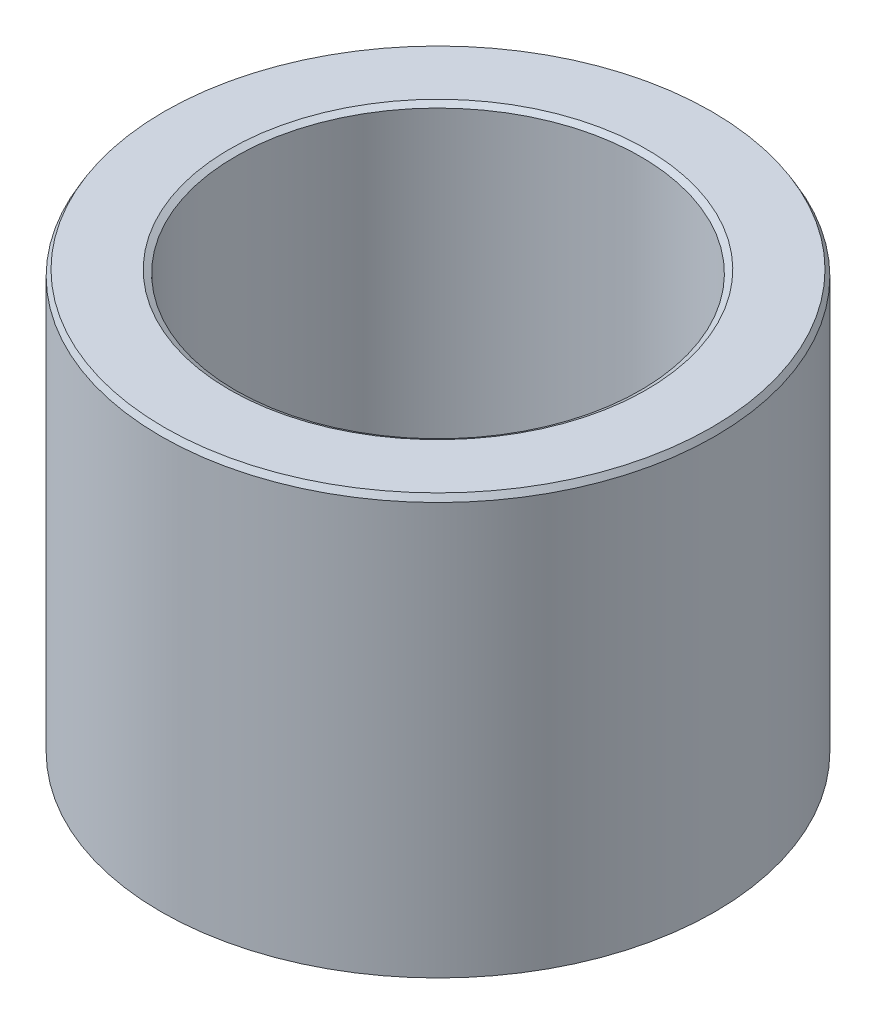
ISO-10303-21;
HEADER;
FILE_DESCRIPTION(('STEP AP214'),'2;1');
FILE_NAME('part.step','',(''),(''),'','','');
FILE_SCHEMA(('AUTOMOTIVE_DESIGN { 1 0 10303 214 1 1 1 1 }'));
ENDSEC;
DATA;
#1=APPLICATION_CONTEXT('core data for automotive mechanical design processes');
#2=APPLICATION_PROTOCOL_DEFINITION('international standard','automotive_design',2000,#1);
#3=PRODUCT_CONTEXT('',#1,'mechanical');
#4=PRODUCT('Part','Part','',(#3));
#5=PRODUCT_RELATED_PRODUCT_CATEGORY('part','',(#4));
#6=PRODUCT_DEFINITION_FORMATION('','',#4);
#7=PRODUCT_DEFINITION_CONTEXT('part definition',#1,'design');
#8=PRODUCT_DEFINITION('design','',#6,#7);
#9=PRODUCT_DEFINITION_SHAPE('','',#8);
#10=(LENGTH_UNIT() NAMED_UNIT(*) SI_UNIT(.MILLI.,.METRE.));
#11=(NAMED_UNIT(*) PLANE_ANGLE_UNIT() SI_UNIT($,.RADIAN.));
#12=(NAMED_UNIT(*) SI_UNIT($,.STERADIAN.) SOLID_ANGLE_UNIT());
#13=UNCERTAINTY_MEASURE_WITH_UNIT(LENGTH_MEASURE(1.E-05),#10,'distance_accuracy_value','');
#14=(GEOMETRIC_REPRESENTATION_CONTEXT(3) GLOBAL_UNCERTAINTY_ASSIGNED_CONTEXT((#13)) GLOBAL_UNIT_ASSIGNED_CONTEXT((#10,
#11,#12)) REPRESENTATION_CONTEXT('',''));
#15=CARTESIAN_POINT('',(0.,0.,0.));
#16=DIRECTION('',(0.,0.,1.));
#17=DIRECTION('',(1.,0.,0.));
#18=AXIS2_PLACEMENT_3D('',#15,#16,#17);
#19=CARTESIAN_POINT('',(0.,64.5880253168317,0.));
#20=DIRECTION('',(0.,-1.,0.));
#21=DIRECTION('',(0.,0.,-1.));
#22=AXIS2_PLACEMENT_3D('',#19,#20,#21);
#23=CYLINDRICAL_SURFACE('',#22,42.5);
#24=CARTESIAN_POINT('',(0.,0.524963603756048,0.));
#25=DIRECTION('',(0.,1.,0.));
#26=DIRECTION('',(0.,0.,1.));
#27=AXIS2_PLACEMENT_3D('',#24,#25,#26);
#28=CIRCLE('',#27,42.5);
#29=CARTESIAN_POINT('',(0.,0.524963603756048,42.5));
#30=VERTEX_POINT('',#29);
#31=EDGE_CURVE('E10',#30,#30,#28,.T.);
#32=ORIENTED_EDGE('',*,*,#31,.T.);
#33=EDGE_LOOP('',(#32));
#34=FACE_BOUND('',#33,.T.);
#35=CARTESIAN_POINT('',(0.,63.6787616830017,0.));
#36=DIRECTION('',(0.,1.,0.));
#37=DIRECTION('',(0.,0.,1.));
#38=AXIS2_PLACEMENT_3D('',#35,#36,#37);
#39=CIRCLE('',#38,42.5);
#40=CARTESIAN_POINT('',(0.,63.6787616830017,42.5));
#41=VERTEX_POINT('',#40);
#42=EDGE_CURVE('E50',#41,#41,#39,.F.);
#43=ORIENTED_EDGE('',*,*,#42,.T.);
#44=EDGE_LOOP('',(#43));
#45=FACE_BOUND('',#44,.T.);
#46=ADVANCED_FACE('F39',(#34,#45),#23,.T.);
#47=CARTESIAN_POINT('',(0.,64.5880253168317,0.));
#48=DIRECTION('',(0.,1.,0.));
#49=DIRECTION('',(0.,0.,1.));
#50=AXIS2_PLACEMENT_3D('',#47,#48,#49);
#51=PLANE('',#50);
#52=CARTESIAN_POINT('',(0.,64.5880253168317,0.));
#53=DIRECTION('',(0.,1.,0.));
#54=DIRECTION('',(0.,0.,1.));
#55=AXIS2_PLACEMENT_3D('',#52,#53,#54);
#56=CIRCLE('',#55,31.9728444741775);
#57=CARTESIAN_POINT('',(0.,64.5880253168317,31.9728444741775));
#58=VERTEX_POINT('',#57);
#59=EDGE_CURVE('E58',#58,#58,#56,.F.);
#60=ORIENTED_EDGE('',*,*,#59,.T.);
#61=EDGE_LOOP('',(#60));
#62=FACE_BOUND('',#61,.T.);
#63=CARTESIAN_POINT('',(0.,64.5880253168317,0.));
#64=DIRECTION('',(0.,1.,0.));
#65=DIRECTION('',(0.,0.,1.));
#66=AXIS2_PLACEMENT_3D('',#63,#64,#65);
#67=CIRCLE('',#66,41.9750363962439);
#68=CARTESIAN_POINT('',(0.,64.5880253168317,41.9750363962439));
#69=VERTEX_POINT('',#68);
#70=EDGE_CURVE('E61',#69,#69,#67,.T.);
#71=ORIENTED_EDGE('',*,*,#70,.T.);
#72=EDGE_LOOP('',(#71));
#73=FACE_BOUND('',#72,.T.);
#74=ADVANCED_FACE('F88',(#62,#73),#51,.T.);
#75=CARTESIAN_POINT('',(0.,0.,0.));
#76=DIRECTION('',(0.,1.,0.));
#77=DIRECTION('',(0.,0.,1.));
#78=AXIS2_PLACEMENT_3D('',#75,#76,#77);
#79=PLANE('',#78);
#80=CARTESIAN_POINT('',(0.,0.,0.));
#81=DIRECTION('',(0.,1.,0.));
#82=DIRECTION('',(0.,0.,1.));
#83=AXIS2_PLACEMENT_3D('',#80,#81,#82);
#84=CIRCLE('',#83,31.5885444441036);
#85=CARTESIAN_POINT('',(0.,0.,31.5885444441036));
#86=VERTEX_POINT('',#85);
#87=EDGE_CURVE('E51',#86,#86,#84,.T.);
#88=ORIENTED_EDGE('',*,*,#87,.T.);
#89=EDGE_LOOP('',(#88));
#90=FACE_BOUND('',#89,.T.);
#91=CARTESIAN_POINT('',(0.,0.,0.));
#92=DIRECTION('',(0.,1.,0.));
#93=DIRECTION('',(0.,0.,1.));
#94=AXIS2_PLACEMENT_3D('',#91,#92,#93);
#95=CIRCLE('',#94,41.5907363661701);
#96=CARTESIAN_POINT('',(0.,0.,41.5907363661701));
#97=VERTEX_POINT('',#96);
#98=EDGE_CURVE('E54',#97,#97,#95,.F.);
#99=ORIENTED_EDGE('',*,*,#98,.T.);
#100=EDGE_LOOP('',(#99));
#101=FACE_BOUND('',#100,.T.);
#102=ADVANCED_FACE('F83',(#90,#101),#79,.F.);
#103=CARTESIAN_POINT('',(0.,64.5880253168317,0.));
#104=DIRECTION('',(0.,-1.,0.));
#105=DIRECTION('',(0.,0.,-1.));
#106=AXIS2_PLACEMENT_3D('',#103,#104,#105);
#107=CYLINDRICAL_SURFACE('',#106,31.0635808403476);
#108=CARTESIAN_POINT('',(0.,64.0630617130757,0.));
#109=DIRECTION('',(0.,1.,0.));
#110=DIRECTION('',(0.,0.,1.));
#111=AXIS2_PLACEMENT_3D('',#108,#109,#110);
#112=CIRCLE('',#111,31.0635808403476);
#113=CARTESIAN_POINT('',(0.,64.0630617130757,31.0635808403476));
#114=VERTEX_POINT('',#113);
#115=EDGE_CURVE('E67',#114,#114,#112,.T.);
#116=ORIENTED_EDGE('',*,*,#115,.T.);
#117=EDGE_LOOP('',(#116));
#118=FACE_BOUND('',#117,.T.);
#119=CARTESIAN_POINT('',(0.,0.909263633829926,0.));
#120=DIRECTION('',(0.,1.,0.));
#121=DIRECTION('',(0.,0.,1.));
#122=AXIS2_PLACEMENT_3D('',#119,#120,#121);
#123=CIRCLE('',#122,31.0635808403476);
#124=CARTESIAN_POINT('',(0.,0.909263633829926,31.0635808403476));
#125=VERTEX_POINT('',#124);
#126=EDGE_CURVE('E69',#125,#125,#123,.F.);
#127=ORIENTED_EDGE('',*,*,#126,.T.);
#128=EDGE_LOOP('',(#127));
#129=FACE_BOUND('',#128,.T.);
#130=ADVANCED_FACE('F71',(#118,#129),#107,.F.);
#131=CARTESIAN_POINT('',(0.,64.0630617130757,0.));
#132=DIRECTION('',(0.,1.,0.));
#133=DIRECTION('',(0.,0.,1.));
#134=AXIS2_PLACEMENT_3D('',#131,#132,#133);
#135=CONICAL_SURFACE('',#134,31.0635808403476,1.04719755119659);
#136=ORIENTED_EDGE('',*,*,#59,.F.);
#137=EDGE_LOOP('',(#136));
#138=FACE_BOUND('',#137,.T.);
#139=ORIENTED_EDGE('',*,*,#115,.F.);
#140=EDGE_LOOP('',(#139));
#141=FACE_BOUND('',#140,.T.);
#142=ADVANCED_FACE('F77',(#138,#141),#135,.F.);
#143=CARTESIAN_POINT('',(0.,0.,0.));
#144=DIRECTION('',(0.,-1.,0.));
#145=DIRECTION('',(0.,0.,-1.));
#146=AXIS2_PLACEMENT_3D('',#143,#144,#145);
#147=CONICAL_SURFACE('',#146,31.5885444441036,0.523598775598299);
#148=ORIENTED_EDGE('',*,*,#126,.F.);
#149=EDGE_LOOP('',(#148));
#150=FACE_BOUND('',#149,.T.);
#151=ORIENTED_EDGE('',*,*,#87,.F.);
#152=EDGE_LOOP('',(#151));
#153=FACE_BOUND('',#152,.T.);
#154=ADVANCED_FACE('F73',(#150,#153),#147,.F.);
#155=CARTESIAN_POINT('',(0.,0.524963603756048,0.));
#156=DIRECTION('',(0.,1.,0.));
#157=DIRECTION('',(0.,0.,1.));
#158=AXIS2_PLACEMENT_3D('',#155,#156,#157);
#159=CONICAL_SURFACE('',#158,42.5,1.0471975511966);
#160=ORIENTED_EDGE('',*,*,#98,.F.);
#161=EDGE_LOOP('',(#160));
#162=FACE_BOUND('',#161,.T.);
#163=ORIENTED_EDGE('',*,*,#31,.F.);
#164=EDGE_LOOP('',(#163));
#165=FACE_BOUND('',#164,.T.);
#166=ADVANCED_FACE('F76',(#162,#165),#159,.T.);
#167=CARTESIAN_POINT('',(0.,64.5880253168317,0.));
#168=DIRECTION('',(0.,-1.,0.));
#169=DIRECTION('',(0.,0.,-1.));
#170=AXIS2_PLACEMENT_3D('',#167,#168,#169);
#171=CONICAL_SURFACE('',#170,41.9750363962439,0.523598775598291);
#172=ORIENTED_EDGE('',*,*,#42,.F.);
#173=EDGE_LOOP('',(#172));
#174=FACE_BOUND('',#173,.T.);
#175=ORIENTED_EDGE('',*,*,#70,.F.);
#176=EDGE_LOOP('',(#175));
#177=FACE_BOUND('',#176,.T.);
#178=ADVANCED_FACE('F45',(#174,#177),#171,.T.);
#179=CLOSED_SHELL('',(#46,#74,#102,#130,#142,#154,#166,#178));
#180=MANIFOLD_SOLID_BREP('B2',#179);
#181=ADVANCED_BREP_SHAPE_REPRESENTATION('',(#18,#180),#14);
#182=SHAPE_DEFINITION_REPRESENTATION(#9,#181);
ENDSEC;
END-ISO-10303-21;
